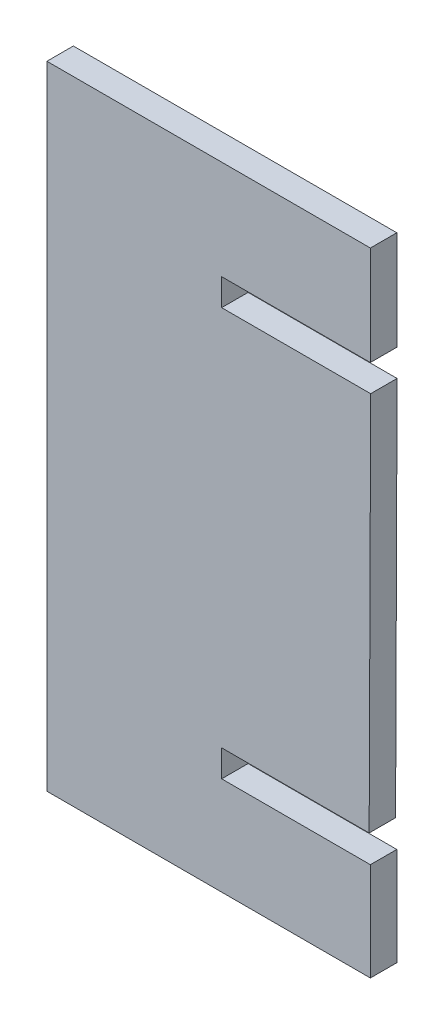
ISO-10303-21;
HEADER;
FILE_DESCRIPTION(('STEP AP214'),'2;1');
FILE_NAME('part.step','',(''),(''),'','','');
FILE_SCHEMA(('AUTOMOTIVE_DESIGN { 1 0 10303 214 1 1 1 1 }'));
ENDSEC;
DATA;
#1=APPLICATION_CONTEXT('core data for automotive mechanical design processes');
#2=APPLICATION_PROTOCOL_DEFINITION('international standard','automotive_design',2000,#1);
#3=PRODUCT_CONTEXT('',#1,'mechanical');
#4=PRODUCT('Part','Part','',(#3));
#5=PRODUCT_RELATED_PRODUCT_CATEGORY('part','',(#4));
#6=PRODUCT_DEFINITION_FORMATION('','',#4);
#7=PRODUCT_DEFINITION_CONTEXT('part definition',#1,'design');
#8=PRODUCT_DEFINITION('design','',#6,#7);
#9=PRODUCT_DEFINITION_SHAPE('','',#8);
#10=(LENGTH_UNIT() NAMED_UNIT(*) SI_UNIT(.MILLI.,.METRE.));
#11=(NAMED_UNIT(*) PLANE_ANGLE_UNIT() SI_UNIT($,.RADIAN.));
#12=(NAMED_UNIT(*) SI_UNIT($,.STERADIAN.) SOLID_ANGLE_UNIT());
#13=UNCERTAINTY_MEASURE_WITH_UNIT(LENGTH_MEASURE(1.E-05),#10,'distance_accuracy_value','');
#14=(GEOMETRIC_REPRESENTATION_CONTEXT(3) GLOBAL_UNCERTAINTY_ASSIGNED_CONTEXT((#13)) GLOBAL_UNIT_ASSIGNED_CONTEXT((#10,
#11,#12)) REPRESENTATION_CONTEXT('',''));
#15=CARTESIAN_POINT('',(0.,0.,0.));
#16=DIRECTION('',(0.,0.,1.));
#17=DIRECTION('',(1.,0.,0.));
#18=AXIS2_PLACEMENT_3D('',#15,#16,#17);
#19=CARTESIAN_POINT('',(-3.0631003,-5.9817,0.499999));
#20=DIRECTION('',(0.,0.,-1.));
#21=DIRECTION('',(0.,-1.,0.));
#22=AXIS2_PLACEMENT_3D('',#19,#20,#21);
#23=PLANE('',#22);
#24=DIRECTION('',(1.,0.,0.));
#25=VECTOR('',#24,1.);
#26=CARTESIAN_POINT('',(-3.0631003,-5.9817,0.499999));
#27=LINE('',#26,#25);
#28=CARTESIAN_POINT('',(-3.0631003,-5.9817,0.499999));
#29=VERTEX_POINT('',#28);
#30=CARTESIAN_POINT('',(3.05770026,-5.9817,0.499999));
#31=VERTEX_POINT('',#30);
#32=EDGE_CURVE('E153',#29,#31,#27,.T.);
#33=ORIENTED_EDGE('',*,*,#32,.T.);
#34=DIRECTION('',(0.,1.,0.));
#35=VECTOR('',#34,1.);
#36=CARTESIAN_POINT('',(3.05770026,-5.9817,0.499999));
#37=LINE('',#36,#35);
#38=CARTESIAN_POINT('',(3.05770026,-4.12469838,0.499999));
#39=VERTEX_POINT('',#38);
#40=EDGE_CURVE('E151',#31,#39,#37,.T.);
#41=ORIENTED_EDGE('',*,*,#40,.T.);
#42=DIRECTION('',(-1.,0.,0.));
#43=VECTOR('',#42,1.);
#44=CARTESIAN_POINT('',(3.05770026,-4.12469838,0.499999));
#45=LINE('',#44,#43);
#46=CARTESIAN_POINT('',(0.24367744,-4.12469838,0.499999));
#47=VERTEX_POINT('',#46);
#48=EDGE_CURVE('E137',#39,#47,#45,.T.);
#49=ORIENTED_EDGE('',*,*,#48,.T.);
#50=DIRECTION('',(0.,1.,0.));
#51=VECTOR('',#50,1.);
#52=CARTESIAN_POINT('',(0.24367744,-4.12469838,0.499999));
#53=LINE('',#52,#51);
#54=CARTESIAN_POINT('',(0.24367744,-3.61669838,0.499999));
#55=VERTEX_POINT('',#54);
#56=EDGE_CURVE('E204',#47,#55,#53,.T.);
#57=ORIENTED_EDGE('',*,*,#56,.T.);
#58=DIRECTION('',(1.,0.,0.));
#59=VECTOR('',#58,1.);
#60=CARTESIAN_POINT('',(0.24367744,-3.61669838,0.499999));
#61=LINE('',#60,#59);
#62=CARTESIAN_POINT('',(3.03469802,-3.61669838,0.499999));
#63=VERTEX_POINT('',#62);
#64=EDGE_CURVE('E194',#55,#63,#61,.T.);
#65=ORIENTED_EDGE('',*,*,#64,.T.);
#66=DIRECTION('',(0.0039372934248008,0.999992248830203,0.));
#67=VECTOR('',#66,1.);
#68=CARTESIAN_POINT('',(3.03469802,-3.61669838,0.499999));
#69=LINE('',#68,#67);
#70=CARTESIAN_POINT('',(3.0631003,3.59690162,0.499999));
#71=VERTEX_POINT('',#70);
#72=EDGE_CURVE('E178',#63,#71,#69,.T.);
#73=ORIENTED_EDGE('',*,*,#72,.T.);
#74=DIRECTION('',(-1.,0.,0.));
#75=VECTOR('',#74,1.);
#76=CARTESIAN_POINT('',(3.0631003,3.59690162,0.499999));
#77=LINE('',#76,#75);
#78=CARTESIAN_POINT('',(0.24367744,3.59690162,0.499999));
#79=VERTEX_POINT('',#78);
#80=EDGE_CURVE('E237',#71,#79,#77,.T.);
#81=ORIENTED_EDGE('',*,*,#80,.T.);
#82=DIRECTION('',(0.,1.,0.));
#83=VECTOR('',#82,1.);
#84=CARTESIAN_POINT('',(0.24367744,3.59690162,0.499999));
#85=LINE('',#84,#83);
#86=CARTESIAN_POINT('',(0.24367744,4.10490162,0.499999));
#87=VERTEX_POINT('',#86);
#88=EDGE_CURVE('E235',#79,#87,#85,.T.);
#89=ORIENTED_EDGE('',*,*,#88,.T.);
#90=DIRECTION('',(1.,0.,0.));
#91=VECTOR('',#90,1.);
#92=CARTESIAN_POINT('',(0.24367744,4.10490162,0.499999));
#93=LINE('',#92,#91);
#94=CARTESIAN_POINT('',(3.05770026,4.10490162,0.499999));
#95=VERTEX_POINT('',#94);
#96=EDGE_CURVE('E176',#87,#95,#93,.T.);
#97=ORIENTED_EDGE('',*,*,#96,.T.);
#98=DIRECTION('',(0.,1.,0.));
#99=VECTOR('',#98,1.);
#100=CARTESIAN_POINT('',(3.05770026,4.10490162,0.499999));
#101=LINE('',#100,#99);
#102=CARTESIAN_POINT('',(3.05770026,5.9817,0.499999));
#103=VERTEX_POINT('',#102);
#104=EDGE_CURVE('E268',#95,#103,#101,.T.);
#105=ORIENTED_EDGE('',*,*,#104,.T.);
#106=DIRECTION('',(-1.,0.,0.));
#107=VECTOR('',#106,1.);
#108=CARTESIAN_POINT('',(3.05770026,5.9817,0.499999));
#109=LINE('',#108,#107);
#110=CARTESIAN_POINT('',(-3.0631003,5.9817,0.499999));
#111=VERTEX_POINT('',#110);
#112=EDGE_CURVE('E222',#103,#111,#109,.T.);
#113=ORIENTED_EDGE('',*,*,#112,.T.);
#114=DIRECTION('',(0.,-1.,0.));
#115=VECTOR('',#114,1.);
#116=CARTESIAN_POINT('',(-3.0631003,5.9817,0.499999));
#117=LINE('',#116,#115);
#118=EDGE_CURVE('E11',#111,#29,#117,.T.);
#119=ORIENTED_EDGE('',*,*,#118,.T.);
#120=EDGE_LOOP('',(#33,#41,#49,#57,#65,#73,#81,#89,#97,#105,#113,#119));
#121=FACE_BOUND('',#120,.T.);
#122=ADVANCED_FACE('F17',(#121),#23,.F.);
#123=CARTESIAN_POINT('',(-3.0631003,-5.9817,0.));
#124=DIRECTION('',(0.,0.,-1.));
#125=DIRECTION('',(0.,-1.,0.));
#126=AXIS2_PLACEMENT_3D('',#123,#124,#125);
#127=PLANE('',#126);
#128=DIRECTION('',(1.,0.,0.));
#129=VECTOR('',#128,1.);
#130=CARTESIAN_POINT('',(-3.0631003,-5.9817,0.));
#131=LINE('',#130,#129);
#132=CARTESIAN_POINT('',(-3.0631003,-5.9817,0.));
#133=VERTEX_POINT('',#132);
#134=CARTESIAN_POINT('',(3.05770026,-5.9817,0.));
#135=VERTEX_POINT('',#134);
#136=EDGE_CURVE('E184',#133,#135,#131,.T.);
#137=ORIENTED_EDGE('',*,*,#136,.F.);
#138=DIRECTION('',(0.,-1.,0.));
#139=VECTOR('',#138,1.);
#140=CARTESIAN_POINT('',(-3.0631003,5.9817,0.));
#141=LINE('',#140,#139);
#142=CARTESIAN_POINT('',(-3.0631003,5.9817,0.));
#143=VERTEX_POINT('',#142);
#144=EDGE_CURVE('E28',#143,#133,#141,.T.);
#145=ORIENTED_EDGE('',*,*,#144,.F.);
#146=DIRECTION('',(-1.,0.,0.));
#147=VECTOR('',#146,1.);
#148=CARTESIAN_POINT('',(3.05770026,5.9817,0.));
#149=LINE('',#148,#147);
#150=CARTESIAN_POINT('',(3.05770026,5.9817,0.));
#151=VERTEX_POINT('',#150);
#152=EDGE_CURVE('E223',#151,#143,#149,.T.);
#153=ORIENTED_EDGE('',*,*,#152,.F.);
#154=DIRECTION('',(0.,1.,0.));
#155=VECTOR('',#154,1.);
#156=CARTESIAN_POINT('',(3.05770026,4.10490162,0.));
#157=LINE('',#156,#155);
#158=CARTESIAN_POINT('',(3.05770026,4.10490162,0.));
#159=VERTEX_POINT('',#158);
#160=EDGE_CURVE('E196',#159,#151,#157,.T.);
#161=ORIENTED_EDGE('',*,*,#160,.F.);
#162=DIRECTION('',(1.,0.,0.));
#163=VECTOR('',#162,1.);
#164=CARTESIAN_POINT('',(0.24367744,4.10490162,0.));
#165=LINE('',#164,#163);
#166=CARTESIAN_POINT('',(0.24367744,4.10490162,0.));
#167=VERTEX_POINT('',#166);
#168=EDGE_CURVE('E177',#167,#159,#165,.T.);
#169=ORIENTED_EDGE('',*,*,#168,.F.);
#170=DIRECTION('',(0.,1.,0.));
#171=VECTOR('',#170,1.);
#172=CARTESIAN_POINT('',(0.24367744,3.59690162,0.));
#173=LINE('',#172,#171);
#174=CARTESIAN_POINT('',(0.24367744,3.59690162,0.));
#175=VERTEX_POINT('',#174);
#176=EDGE_CURVE('E236',#175,#167,#173,.T.);
#177=ORIENTED_EDGE('',*,*,#176,.F.);
#178=DIRECTION('',(-1.,0.,0.));
#179=VECTOR('',#178,1.);
#180=CARTESIAN_POINT('',(3.0631003,3.59690162,0.));
#181=LINE('',#180,#179);
#182=CARTESIAN_POINT('',(3.0631003,3.59690162,0.));
#183=VERTEX_POINT('',#182);
#184=EDGE_CURVE('E182',#183,#175,#181,.T.);
#185=ORIENTED_EDGE('',*,*,#184,.F.);
#186=DIRECTION('',(0.0039372934248008,0.999992248830203,0.));
#187=VECTOR('',#186,1.);
#188=CARTESIAN_POINT('',(3.03469802,-3.61669838,0.));
#189=LINE('',#188,#187);
#190=CARTESIAN_POINT('',(3.03469802,-3.61669838,0.));
#191=VERTEX_POINT('',#190);
#192=EDGE_CURVE('E211',#191,#183,#189,.T.);
#193=ORIENTED_EDGE('',*,*,#192,.F.);
#194=DIRECTION('',(1.,0.,0.));
#195=VECTOR('',#194,1.);
#196=CARTESIAN_POINT('',(0.24367744,-3.61669838,0.));
#197=LINE('',#196,#195);
#198=CARTESIAN_POINT('',(0.24367744,-3.61669838,0.));
#199=VERTEX_POINT('',#198);
#200=EDGE_CURVE('E195',#199,#191,#197,.T.);
#201=ORIENTED_EDGE('',*,*,#200,.F.);
#202=DIRECTION('',(0.,1.,0.));
#203=VECTOR('',#202,1.);
#204=CARTESIAN_POINT('',(0.24367744,-4.12469838,0.));
#205=LINE('',#204,#203);
#206=CARTESIAN_POINT('',(0.24367744,-4.12469838,0.));
#207=VERTEX_POINT('',#206);
#208=EDGE_CURVE('E128',#207,#199,#205,.T.);
#209=ORIENTED_EDGE('',*,*,#208,.F.);
#210=DIRECTION('',(-1.,0.,0.));
#211=VECTOR('',#210,1.);
#212=CARTESIAN_POINT('',(3.05770026,-4.12469838,0.));
#213=LINE('',#212,#211);
#214=CARTESIAN_POINT('',(3.05770026,-4.12469838,0.));
#215=VERTEX_POINT('',#214);
#216=EDGE_CURVE('E158',#215,#207,#213,.T.);
#217=ORIENTED_EDGE('',*,*,#216,.F.);
#218=DIRECTION('',(0.,1.,0.));
#219=VECTOR('',#218,1.);
#220=CARTESIAN_POINT('',(3.05770026,-5.9817,0.));
#221=LINE('',#220,#219);
#222=EDGE_CURVE('E161',#135,#215,#221,.T.);
#223=ORIENTED_EDGE('',*,*,#222,.F.);
#224=EDGE_LOOP('',(#137,#145,#153,#161,#169,#177,#185,#193,#201,#209,#217,#223));
#225=FACE_BOUND('',#224,.T.);
#226=ADVANCED_FACE('F292',(#225),#127,.T.);
#227=CARTESIAN_POINT('',(-3.0631003,5.9817,0.));
#228=DIRECTION('',(1.,0.,0.));
#229=DIRECTION('',(0.,1.,0.));
#230=AXIS2_PLACEMENT_3D('',#227,#228,#229);
#231=PLANE('',#230);
#232=DIRECTION('',(0.,0.,1.));
#233=VECTOR('',#232,1.);
#234=CARTESIAN_POINT('',(-3.0631003,5.9817,0.));
#235=LINE('',#234,#233);
#236=EDGE_CURVE('E218',#143,#111,#235,.T.);
#237=ORIENTED_EDGE('',*,*,#236,.F.);
#238=ORIENTED_EDGE('',*,*,#144,.T.);
#239=DIRECTION('',(0.,0.,1.));
#240=VECTOR('',#239,1.);
#241=CARTESIAN_POINT('',(-3.0631003,-5.9817,0.));
#242=LINE('',#241,#240);
#243=EDGE_CURVE('E189',#133,#29,#242,.T.);
#244=ORIENTED_EDGE('',*,*,#243,.T.);
#245=ORIENTED_EDGE('',*,*,#118,.F.);
#246=EDGE_LOOP('',(#237,#238,#244,#245));
#247=FACE_BOUND('',#246,.T.);
#248=ADVANCED_FACE('F290',(#247),#231,.F.);
#249=CARTESIAN_POINT('',(3.05770026,5.9817,0.));
#250=DIRECTION('',(0.,-1.,0.));
#251=DIRECTION('',(0.,0.,-1.));
#252=AXIS2_PLACEMENT_3D('',#249,#250,#251);
#253=PLANE('',#252);
#254=DIRECTION('',(0.,0.,1.));
#255=VECTOR('',#254,1.);
#256=CARTESIAN_POINT('',(3.05770026,5.9817,0.));
#257=LINE('',#256,#255);
#258=EDGE_CURVE('E21',#151,#103,#257,.T.);
#259=ORIENTED_EDGE('',*,*,#258,.F.);
#260=ORIENTED_EDGE('',*,*,#152,.T.);
#261=ORIENTED_EDGE('',*,*,#236,.T.);
#262=ORIENTED_EDGE('',*,*,#112,.F.);
#263=EDGE_LOOP('',(#259,#260,#261,#262));
#264=FACE_BOUND('',#263,.T.);
#265=ADVANCED_FACE('F19',(#264),#253,.F.);
#266=CARTESIAN_POINT('',(3.05770026,4.10490162,0.));
#267=DIRECTION('',(-1.,0.,0.));
#268=DIRECTION('',(0.,0.,1.));
#269=AXIS2_PLACEMENT_3D('',#266,#267,#268);
#270=PLANE('',#269);
#271=DIRECTION('',(0.,0.,1.));
#272=VECTOR('',#271,1.);
#273=CARTESIAN_POINT('',(3.05770026,4.10490162,0.));
#274=LINE('',#273,#272);
#275=EDGE_CURVE('E172',#159,#95,#274,.T.);
#276=ORIENTED_EDGE('',*,*,#275,.F.);
#277=ORIENTED_EDGE('',*,*,#160,.T.);
#278=ORIENTED_EDGE('',*,*,#258,.T.);
#279=ORIENTED_EDGE('',*,*,#104,.F.);
#280=EDGE_LOOP('',(#276,#277,#278,#279));
#281=FACE_BOUND('',#280,.T.);
#282=ADVANCED_FACE('F284',(#281),#270,.F.);
#283=CARTESIAN_POINT('',(0.24367744,4.10490162,0.));
#284=DIRECTION('',(0.,1.,0.));
#285=DIRECTION('',(1.,0.,0.));
#286=AXIS2_PLACEMENT_3D('',#283,#284,#285);
#287=PLANE('',#286);
#288=DIRECTION('',(0.,0.,1.));
#289=VECTOR('',#288,1.);
#290=CARTESIAN_POINT('',(0.24367744,4.10490162,0.));
#291=LINE('',#290,#289);
#292=EDGE_CURVE('E232',#167,#87,#291,.T.);
#293=ORIENTED_EDGE('',*,*,#292,.F.);
#294=ORIENTED_EDGE('',*,*,#168,.T.);
#295=ORIENTED_EDGE('',*,*,#275,.T.);
#296=ORIENTED_EDGE('',*,*,#96,.F.);
#297=EDGE_LOOP('',(#293,#294,#295,#296));
#298=FACE_BOUND('',#297,.T.);
#299=ADVANCED_FACE('F308',(#298),#287,.F.);
#300=CARTESIAN_POINT('',(0.24367744,3.59690162,0.));
#301=DIRECTION('',(-1.,0.,0.));
#302=DIRECTION('',(0.,0.,1.));
#303=AXIS2_PLACEMENT_3D('',#300,#301,#302);
#304=PLANE('',#303);
#305=DIRECTION('',(0.,0.,1.));
#306=VECTOR('',#305,1.);
#307=CARTESIAN_POINT('',(0.24367744,3.59690162,0.));
#308=LINE('',#307,#306);
#309=EDGE_CURVE('E231',#175,#79,#308,.T.);
#310=ORIENTED_EDGE('',*,*,#309,.F.);
#311=ORIENTED_EDGE('',*,*,#176,.T.);
#312=ORIENTED_EDGE('',*,*,#292,.T.);
#313=ORIENTED_EDGE('',*,*,#88,.F.);
#314=EDGE_LOOP('',(#310,#311,#312,#313));
#315=FACE_BOUND('',#314,.T.);
#316=ADVANCED_FACE('F321',(#315),#304,.F.);
#317=CARTESIAN_POINT('',(3.0631003,3.59690162,0.));
#318=DIRECTION('',(0.,-1.,0.));
#319=DIRECTION('',(0.,0.,-1.));
#320=AXIS2_PLACEMENT_3D('',#317,#318,#319);
#321=PLANE('',#320);
#322=DIRECTION('',(0.,0.,1.));
#323=VECTOR('',#322,1.);
#324=CARTESIAN_POINT('',(3.0631003,3.59690162,0.));
#325=LINE('',#324,#323);
#326=EDGE_CURVE('E183',#183,#71,#325,.T.);
#327=ORIENTED_EDGE('',*,*,#326,.F.);
#328=ORIENTED_EDGE('',*,*,#184,.T.);
#329=ORIENTED_EDGE('',*,*,#309,.T.);
#330=ORIENTED_EDGE('',*,*,#80,.F.);
#331=EDGE_LOOP('',(#327,#328,#329,#330));
#332=FACE_BOUND('',#331,.T.);
#333=ADVANCED_FACE('F304',(#332),#321,.F.);
#334=CARTESIAN_POINT('',(3.03469802,-3.61669838,0.));
#335=DIRECTION('',(-0.999992248830203,0.0039372934248008,0.));
#336=DIRECTION('',(0.,0.,1.));
#337=AXIS2_PLACEMENT_3D('',#334,#335,#336);
#338=PLANE('',#337);
#339=DIRECTION('',(0.,0.,1.));
#340=VECTOR('',#339,1.);
#341=CARTESIAN_POINT('',(3.03469802,-3.61669838,0.));
#342=LINE('',#341,#340);
#343=EDGE_CURVE('E190',#191,#63,#342,.T.);
#344=ORIENTED_EDGE('',*,*,#343,.F.);
#345=ORIENTED_EDGE('',*,*,#192,.T.);
#346=ORIENTED_EDGE('',*,*,#326,.T.);
#347=ORIENTED_EDGE('',*,*,#72,.F.);
#348=EDGE_LOOP('',(#344,#345,#346,#347));
#349=FACE_BOUND('',#348,.T.);
#350=ADVANCED_FACE('F314',(#349),#338,.F.);
#351=CARTESIAN_POINT('',(0.24367744,-3.61669838,0.));
#352=DIRECTION('',(0.,1.,0.));
#353=DIRECTION('',(1.,0.,0.));
#354=AXIS2_PLACEMENT_3D('',#351,#352,#353);
#355=PLANE('',#354);
#356=DIRECTION('',(0.,0.,1.));
#357=VECTOR('',#356,1.);
#358=CARTESIAN_POINT('',(0.24367744,-3.61669838,0.));
#359=LINE('',#358,#357);
#360=EDGE_CURVE('E200',#199,#55,#359,.T.);
#361=ORIENTED_EDGE('',*,*,#360,.F.);
#362=ORIENTED_EDGE('',*,*,#200,.T.);
#363=ORIENTED_EDGE('',*,*,#343,.T.);
#364=ORIENTED_EDGE('',*,*,#64,.F.);
#365=EDGE_LOOP('',(#361,#362,#363,#364));
#366=FACE_BOUND('',#365,.T.);
#367=ADVANCED_FACE('F317',(#366),#355,.F.);
#368=CARTESIAN_POINT('',(0.24367744,-4.12469838,0.));
#369=DIRECTION('',(-1.,0.,0.));
#370=DIRECTION('',(0.,0.,1.));
#371=AXIS2_PLACEMENT_3D('',#368,#369,#370);
#372=PLANE('',#371);
#373=DIRECTION('',(0.,0.,1.));
#374=VECTOR('',#373,1.);
#375=CARTESIAN_POINT('',(0.24367744,-4.12469838,0.));
#376=LINE('',#375,#374);
#377=EDGE_CURVE('E144',#207,#47,#376,.T.);
#378=ORIENTED_EDGE('',*,*,#377,.F.);
#379=ORIENTED_EDGE('',*,*,#208,.T.);
#380=ORIENTED_EDGE('',*,*,#360,.T.);
#381=ORIENTED_EDGE('',*,*,#56,.F.);
#382=EDGE_LOOP('',(#378,#379,#380,#381));
#383=FACE_BOUND('',#382,.T.);
#384=ADVANCED_FACE('F311',(#383),#372,.F.);
#385=CARTESIAN_POINT('',(3.05770026,-4.12469838,0.));
#386=DIRECTION('',(0.,-1.,0.));
#387=DIRECTION('',(0.,0.,-1.));
#388=AXIS2_PLACEMENT_3D('',#385,#386,#387);
#389=PLANE('',#388);
#390=DIRECTION('',(0.,0.,1.));
#391=VECTOR('',#390,1.);
#392=CARTESIAN_POINT('',(3.05770026,-4.12469838,0.));
#393=LINE('',#392,#391);
#394=EDGE_CURVE('E142',#215,#39,#393,.T.);
#395=ORIENTED_EDGE('',*,*,#394,.F.);
#396=ORIENTED_EDGE('',*,*,#216,.T.);
#397=ORIENTED_EDGE('',*,*,#377,.T.);
#398=ORIENTED_EDGE('',*,*,#48,.F.);
#399=EDGE_LOOP('',(#395,#396,#397,#398));
#400=FACE_BOUND('',#399,.T.);
#401=ADVANCED_FACE('F139',(#400),#389,.F.);
#402=CARTESIAN_POINT('',(3.05770026,-5.9817,0.));
#403=DIRECTION('',(-1.,0.,0.));
#404=DIRECTION('',(0.,0.,1.));
#405=AXIS2_PLACEMENT_3D('',#402,#403,#404);
#406=PLANE('',#405);
#407=DIRECTION('',(0.,0.,1.));
#408=VECTOR('',#407,1.);
#409=CARTESIAN_POINT('',(3.05770026,-5.9817,0.));
#410=LINE('',#409,#408);
#411=EDGE_CURVE('E188',#135,#31,#410,.T.);
#412=ORIENTED_EDGE('',*,*,#411,.F.);
#413=ORIENTED_EDGE('',*,*,#222,.T.);
#414=ORIENTED_EDGE('',*,*,#394,.T.);
#415=ORIENTED_EDGE('',*,*,#40,.F.);
#416=EDGE_LOOP('',(#412,#413,#414,#415));
#417=FACE_BOUND('',#416,.T.);
#418=ADVANCED_FACE('F160',(#417),#406,.F.);
#419=CARTESIAN_POINT('',(-3.0631003,-5.9817,0.));
#420=DIRECTION('',(0.,1.,0.));
#421=DIRECTION('',(1.,0.,0.));
#422=AXIS2_PLACEMENT_3D('',#419,#420,#421);
#423=PLANE('',#422);
#424=ORIENTED_EDGE('',*,*,#243,.F.);
#425=ORIENTED_EDGE('',*,*,#136,.T.);
#426=ORIENTED_EDGE('',*,*,#411,.T.);
#427=ORIENTED_EDGE('',*,*,#32,.F.);
#428=EDGE_LOOP('',(#424,#425,#426,#427));
#429=FACE_BOUND('',#428,.T.);
#430=ADVANCED_FACE('F288',(#429),#423,.F.);
#431=CLOSED_SHELL('',(#122,#226,#248,#265,#282,#299,#316,#333,#350,#367,#384,#401,#418,#430));
#432=MANIFOLD_SOLID_BREP('B1',#431);
#433=ADVANCED_BREP_SHAPE_REPRESENTATION('',(#18,#432),#14);
#434=SHAPE_DEFINITION_REPRESENTATION(#9,#433);
ENDSEC;
END-ISO-10303-21;
